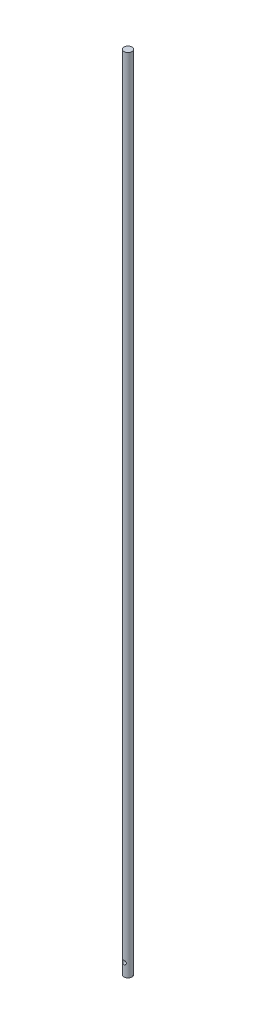
ISO-10303-21;
HEADER;
FILE_DESCRIPTION(('STEP AP214'),'2;1');
FILE_NAME('part.step','',(''),(''),'','','');
FILE_SCHEMA(('AUTOMOTIVE_DESIGN { 1 0 10303 214 1 1 1 1 }'));
ENDSEC;
DATA;
#1=APPLICATION_CONTEXT('core data for automotive mechanical design processes');
#2=APPLICATION_PROTOCOL_DEFINITION('international standard','automotive_design',2000,#1);
#3=PRODUCT_CONTEXT('',#1,'mechanical');
#4=PRODUCT('Part','Part','',(#3));
#5=PRODUCT_RELATED_PRODUCT_CATEGORY('part','',(#4));
#6=PRODUCT_DEFINITION_FORMATION('','',#4);
#7=PRODUCT_DEFINITION_CONTEXT('part definition',#1,'design');
#8=PRODUCT_DEFINITION('design','',#6,#7);
#9=PRODUCT_DEFINITION_SHAPE('','',#8);
#10=(LENGTH_UNIT() NAMED_UNIT(*) SI_UNIT(.MILLI.,.METRE.));
#11=(NAMED_UNIT(*) PLANE_ANGLE_UNIT() SI_UNIT($,.RADIAN.));
#12=(NAMED_UNIT(*) SI_UNIT($,.STERADIAN.) SOLID_ANGLE_UNIT());
#13=UNCERTAINTY_MEASURE_WITH_UNIT(LENGTH_MEASURE(1.E-05),#10,'distance_accuracy_value','');
#14=(GEOMETRIC_REPRESENTATION_CONTEXT(3) GLOBAL_UNCERTAINTY_ASSIGNED_CONTEXT((#13)) GLOBAL_UNIT_ASSIGNED_CONTEXT((#10,
#11,#12)) REPRESENTATION_CONTEXT('',''));
#15=CARTESIAN_POINT('',(0.,0.,0.));
#16=DIRECTION('',(0.,0.,1.));
#17=DIRECTION('',(1.,0.,0.));
#18=AXIS2_PLACEMENT_3D('',#15,#16,#17);
#19=CARTESIAN_POINT('',(0.,635.,0.));
#20=DIRECTION('',(0.,-1.,0.));
#21=DIRECTION('',(0.,0.,-1.));
#22=AXIS2_PLACEMENT_3D('',#19,#20,#21);
#23=CYLINDRICAL_SURFACE('',#22,3.175);
#24=CARTESIAN_POINT('',(0.,11.5000000000001,-3.175));
#25=CARTESIAN_POINT('',(-0.0793696056331806,11.4999955261037,-3.17499621985294));
#26=CARTESIAN_POINT('',(-0.158848966213305,11.4936633534843,-3.17199120370814));
#27=CARTESIAN_POINT('',(-0.315490796657684,11.4685996128575,-3.16026762742417));
#28=CARTESIAN_POINT('',(-0.392647876041661,11.4498412211258,-3.15153670753249));
#29=CARTESIAN_POINT('',(-0.542134614016446,11.4008046338603,-3.12928185140191));
#30=CARTESIAN_POINT('',(-0.614481134826971,11.3705694746881,-3.11577583396693));
#31=CARTESIAN_POINT('',(-0.752982757479876,11.2996444683175,-3.08523557557938));
#32=CARTESIAN_POINT('',(-0.819138798736997,11.2589562109142,-3.06820187122341));
#33=CARTESIAN_POINT('',(-0.94753197755138,11.1656866275469,-3.03109215002452));
#34=CARTESIAN_POINT('',(-1.00934531536297,11.1125689176526,-3.0108994960739));
#35=CARTESIAN_POINT('',(-1.1235687280467,10.9970940154181,-2.97016877751052));
#36=CARTESIAN_POINT('',(-1.1759724512306,10.9347306335115,-2.94963048974006));
#37=CARTESIAN_POINT('',(-1.27340721108708,10.7974843645497,-2.90895734211162));
#38=CARTESIAN_POINT('',(-1.31770529611401,10.7220415431449,-2.88894252906622));
#39=CARTESIAN_POINT('',(-1.39279860497067,10.5637145060508,-2.85350194913633));
#40=CARTESIAN_POINT('',(-1.4236026358555,10.4808351865709,-2.83807319122875));
#41=CARTESIAN_POINT('',(-1.46896762087975,10.3148173299765,-2.81484981523147));
#42=CARTESIAN_POINT('',(-1.48434942407678,10.2319591045865,-2.80667245171199));
#43=CARTESIAN_POINT('',(-1.50096994970779,10.0644666996695,-2.79782290647242));
#44=CARTESIAN_POINT('',(-1.50222015512641,9.97983401805994,-2.79714463118969));
#45=CARTESIAN_POINT('',(-1.49114871052963,9.82062469140227,-2.80305593263809));
#46=CARTESIAN_POINT('',(-1.48022366031688,9.74591684055565,-2.80889771224103));
#47=CARTESIAN_POINT('',(-1.44750469243097,9.59955531913525,-2.82589657910715));
#48=CARTESIAN_POINT('',(-1.42570787921158,9.52790246774061,-2.83705508237193));
#49=CARTESIAN_POINT('',(-1.37144042107044,9.38767854274785,-2.86368711079333));
#50=CARTESIAN_POINT('',(-1.33873421633753,9.3192173067294,-2.87925460442575));
#51=CARTESIAN_POINT('',(-1.26375034917988,9.18844422930819,-2.91294481240157));
#52=CARTESIAN_POINT('',(-1.22146847336963,9.12613511227864,-2.93106865023239));
#53=CARTESIAN_POINT('',(-1.12301829304093,9.00211398210143,-2.97027967308475));
#54=CARTESIAN_POINT('',(-1.06582685913966,8.94124465826452,-2.99147184174414));
#55=CARTESIAN_POINT('',(-0.94191165452174,8.82963307898788,-3.03276969244737));
#56=CARTESIAN_POINT('',(-0.875184240523152,8.77889471198727,-3.05287495516681));
#57=CARTESIAN_POINT('',(-0.730900451942534,8.68723446950543,-3.09065813188422));
#58=CARTESIAN_POINT('',(-0.6530327647494,8.64674987490942,-3.10821737934191));
#59=CARTESIAN_POINT('',(-0.490549806409977,8.57976514725874,-3.13795896561378));
#60=CARTESIAN_POINT('',(-0.405939389394631,8.55325505672057,-3.15014513198241));
#61=CARTESIAN_POINT('',(-0.239325331183679,8.51695327830056,-3.16698849385516));
#62=CARTESIAN_POINT('',(-0.157618085372384,8.50603697774869,-3.17215069636453));
#63=CARTESIAN_POINT('',(0.00662006237332813,8.49776549827474,-3.17605374308904));
#64=CARTESIAN_POINT('',(0.0891506200914207,8.50040487103401,-3.17479716715133));
#65=CARTESIAN_POINT('',(0.246790904756247,8.51845895022595,-3.16631250425399));
#66=CARTESIAN_POINT('',(0.322025617263283,8.53299968212116,-3.15949303898597));
#67=CARTESIAN_POINT('',(0.468859911387632,8.57312746629386,-3.14106249856194));
#68=CARTESIAN_POINT('',(0.540459070755479,8.5987157984244,-3.12945086824544));
#69=CARTESIAN_POINT('',(0.680482664613309,8.66097277598056,-3.10206629000487));
#70=CARTESIAN_POINT('',(0.748744433690331,8.69795459585583,-3.0861775760538));
#71=CARTESIAN_POINT('',(0.878333413113481,8.78160542554885,-3.05182842645659));
#72=CARTESIAN_POINT('',(0.93965756245345,8.82827868585655,-3.0333668635778));
#73=CARTESIAN_POINT('',(1.05944471500475,8.93484016430622,-2.99374847615918));
#74=CARTESIAN_POINT('',(1.11715821701519,8.99553803008258,-2.97249840501298));
#75=CARTESIAN_POINT('',(1.2218758216397,9.12592004337332,-2.93101070264009));
#76=CARTESIAN_POINT('',(1.2688744384349,9.1956087655742,-2.91077359415055));
#77=CARTESIAN_POINT('',(1.35231773600021,9.34515860569978,-2.87298422238289));
#78=CARTESIAN_POINT('',(1.3883357483136,9.42529027685061,-2.85555063245793));
#79=CARTESIAN_POINT('',(1.44599796651068,9.59157573608094,-2.82679504093384));
#80=CARTESIAN_POINT('',(1.46765854978947,9.67772253828128,-2.81546607860886));
#81=CARTESIAN_POINT('',(1.49416555358527,9.84513659709302,-2.80148148307169));
#82=CARTESIAN_POINT('',(1.50036748851185,9.92613047173134,-2.79812792823293));
#83=CARTESIAN_POINT('',(1.4995991124721,10.0880256718279,-2.79854075870541));
#84=CARTESIAN_POINT('',(1.4926327833113,10.1689270178634,-2.80230499174774));
#85=CARTESIAN_POINT('',(1.46695547456855,10.3218618581667,-2.81582109373829));
#86=CARTESIAN_POINT('',(1.44918362899975,10.394100315709,-2.82509293077012));
#87=CARTESIAN_POINT('',(1.40347262111119,10.5345289541074,-2.84807658169595));
#88=CARTESIAN_POINT('',(1.37553039996269,10.6027179098565,-2.86178973121637));
#89=CARTESIAN_POINT('',(1.30816165903837,10.7381105518292,-2.89323433363552));
#90=CARTESIAN_POINT('',(1.2680940753401,10.8049459695603,-2.91117262211889));
#91=CARTESIAN_POINT('',(1.1783806973407,10.9313607981843,-2.94862781691945));
#92=CARTESIAN_POINT('',(1.12873032344156,10.9909367174796,-2.96814547541437));
#93=CARTESIAN_POINT('',(1.01518945377103,11.1075560784686,-3.00898948839188));
#94=CARTESIAN_POINT('',(0.950355540908533,11.1636938134171,-3.03029315236505));
#95=CARTESIAN_POINT('',(0.811506446201228,11.264441754275,-3.07039060771353));
#96=CARTESIAN_POINT('',(0.737486850130151,11.3090463858981,-3.08918318329392));
#97=CARTESIAN_POINT('',(0.582310323359665,11.3850463197749,-3.12214803509559));
#98=CARTESIAN_POINT('',(0.501179295246573,11.4164873338392,-3.13633626105316));
#99=CARTESIAN_POINT('',(0.33404120248953,11.4649024240256,-3.15849550789229));
#100=CARTESIAN_POINT('',(0.248049357078893,11.4819192475963,-3.16648489362115));
#101=CARTESIAN_POINT('',(0.134449327489625,11.4942064333984,-3.17226666174443));
#102=CARTESIAN_POINT('',(0.107619750816221,11.4963765519968,-3.17328951708221));
#103=CARTESIAN_POINT('',(0.0538643319459629,11.4992741103809,-3.17465683516496));
#104=CARTESIAN_POINT('',(0.0269384876468103,11.5000015184656,-3.17500128300303));
#105=CARTESIAN_POINT('',(0.,11.5000000000001,-3.175));
#106=B_SPLINE_CURVE_WITH_KNOTS('',3,(#24,#25,#26,#27,#28,#29,#30,#31,#32,#33,#34,#35,#36,#37,
#38,#39,#40,#41,#42,#43,#44,#45,#46,#47,#48,#49,#50,#51,#52,#53,#54,#55,#56,#57,#58,#59,#60,#61,
#62,#63,#64,#65,#66,#67,#68,#69,#70,#71,#72,#73,#74,#75,#76,#77,#78,#79,#80,#81,#82,#83,#84,#85,
#86,#87,#88,#89,#90,#91,#92,#93,#94,#95,#96,#97,#98,#99,#100,#101,#102,#103,#104,#105),
.UNSPECIFIED.,.T.,.F.,(4,2,2,2,2,2,2,2,2,2,2,2,2,2,2,2,2,2,2,2,2,2,2,2,2,2,2,2,2,2,2,2,2,2,2,2,
2,2,2,2,4),(0.,0.237998863435115,0.476513162034362,0.714141760487192,0.951734239756919,
1.20256626735199,1.45356698050228,1.72144991719773,1.98915775546695,2.24170968929964,
2.49405639094993,2.72018464462584,2.94637315667187,3.17780125644155,3.4093313852857,
3.66670059385933,3.92416839616743,4.19124985366182,4.45814074508091,4.70459764976703,
4.9509555058397,5.18069145066333,5.41045401730287,5.64720089890941,5.88405183355055,
6.14213867221337,6.40035735120204,6.66760822573518,6.93455372246492,7.17710763594644,
7.41958821796885,7.64352093670393,7.8675210608749,8.10644389425158,8.34548119240928,
8.60934561245709,8.87333732850242,9.13640455025376,9.39868939423,9.47946576344207,
9.56024390756228),.UNSPECIFIED.);
#107=CARTESIAN_POINT('',(0.,11.5000000000001,-3.175));
#108=VERTEX_POINT('',#107);
#109=EDGE_CURVE('E10',#108,#108,#106,.T.);
#110=ORIENTED_EDGE('',*,*,#109,.T.);
#111=EDGE_LOOP('',(#110));
#112=FACE_BOUND('',#111,.T.);
#113=CARTESIAN_POINT('',(1.5,10.,2.7983253920872));
#114=CARTESIAN_POINT('',(1.49999523547047,9.92118925239899,2.79833097649977));
#115=CARTESIAN_POINT('',(1.49374832449328,9.84226438779429,2.80170427159323));
#116=CARTESIAN_POINT('',(1.4690554061353,9.68678533248534,2.81472644561665));
#117=CARTESIAN_POINT('',(1.45058101361493,9.61023709283713,2.82438992585351));
#118=CARTESIAN_POINT('',(1.40237253355637,9.4620473262433,2.84863009396432));
#119=CARTESIAN_POINT('',(1.37269332197988,9.39038386356822,2.86318279906115));
#120=CARTESIAN_POINT('',(1.30308399064544,9.25307060715245,2.89552502377022));
#121=CARTESIAN_POINT('',(1.26315430701282,9.18742055772114,2.91331440566266));
#122=CARTESIAN_POINT('',(1.17074308715242,9.05867675474164,2.95172227722859));
#123=CARTESIAN_POINT('',(1.11755658650798,8.99612211150936,2.97245254188492));
#124=CARTESIAN_POINT('',(1.00161259672225,8.88040856315068,3.01349951044785));
#125=CARTESIAN_POINT('',(0.93885077249198,8.82725393739964,3.03381602228765));
#126=CARTESIAN_POINT('',(0.801034900704557,8.72881062045227,3.07317288716968));
#127=CARTESIAN_POINT('',(0.725476017233409,8.6841654987483,3.09206866660244));
#128=CARTESIAN_POINT('',(0.566861686619207,8.60846247793828,3.1250338159502));
#129=CARTESIAN_POINT('',(0.483810507023606,8.57739690225476,3.13910591174127));
#130=CARTESIAN_POINT('',(0.318263833167192,8.53180568014386,3.16003750546178));
#131=CARTESIAN_POINT('',(0.236079837596879,8.51634019939963,3.1673046412502));
#132=CARTESIAN_POINT('',(0.0699854874354634,8.49931330153707,3.17531500926785));
#133=CARTESIAN_POINT('',(-0.0139239243030745,8.49774448287967,3.17606171435844));
#134=CARTESIAN_POINT('',(-0.17410404695587,8.50814689261955,3.1711569999128));
#135=CARTESIAN_POINT('',(-0.250460926307501,8.51907363157191,3.16599910390163));
#136=CARTESIAN_POINT('',(-0.400106757592272,8.55231548800515,3.15058713309443));
#137=CARTESIAN_POINT('',(-0.473395481043905,8.57463145199998,3.14033267949386));
#138=CARTESIAN_POINT('',(-0.616162159992436,8.63021819188029,3.11549383971164));
#139=CARTESIAN_POINT('',(-0.685567785451905,8.66364599997404,3.10084769916083));
#140=CARTESIAN_POINT('',(-0.81796221828409,8.74031903647797,3.06858481389696));
#141=CARTESIAN_POINT('',(-0.88094866348999,8.78356786011826,3.05096698193042));
#142=CARTESIAN_POINT('',(-1.00453666893051,8.88298223432991,3.01265189942244));
#143=CARTESIAN_POINT('',(-1.06445784147848,8.93994263196852,2.99182009431091));
#144=CARTESIAN_POINT('',(-1.17424124933887,9.06300294035555,2.9504628336178));
#145=CARTESIAN_POINT('',(-1.22409717105708,9.12910854404883,2.92993757775204));
#146=CARTESIAN_POINT('',(-1.31484174230843,9.27282786184891,2.89039711066439));
#147=CARTESIAN_POINT('',(-1.35512986365459,9.35086105800369,2.87151577260244));
#148=CARTESIAN_POINT('',(-1.42170562946271,9.51371625646894,2.83914834140002));
#149=CARTESIAN_POINT('',(-1.44800645544407,9.59853178012434,2.82565717160028));
#150=CARTESIAN_POINT('',(-1.48387059914898,9.76574629526237,2.8069797461398));
#151=CARTESIAN_POINT('',(-1.49454991359959,9.84784244193012,2.80124227464674));
#152=CARTESIAN_POINT('',(-1.50221328025957,10.0128364544628,2.79714234532468));
#153=CARTESIAN_POINT('',(-1.49920488189904,10.0957338532268,2.79877582206013));
#154=CARTESIAN_POINT('',(-1.48060173475641,10.2518411011807,2.80865284380238));
#155=CARTESIAN_POINT('',(-1.46619608896936,10.3252381335396,2.81627144126263));
#156=CARTESIAN_POINT('',(-1.42690562153977,10.4684636330513,2.83637948512088));
#157=CARTESIAN_POINT('',(-1.40201781025964,10.5382910757385,2.84887032106379));
#158=CARTESIAN_POINT('',(-1.34123245942743,10.6760358075249,2.87800314814946));
#159=CARTESIAN_POINT('',(-1.3048795889842,10.74371599414,2.8948101939309));
#160=CARTESIAN_POINT('',(-1.22260967416885,10.8723898286007,2.93050507850423));
#161=CARTESIAN_POINT('',(-1.17668785898321,10.933380117806,2.94939395301751));
#162=CARTESIAN_POINT('',(-1.07066250220432,11.0539512242928,2.98962533435875));
#163=CARTESIAN_POINT('',(-1.00955462247672,11.1126390091906,3.01100918444459));
#164=CARTESIAN_POINT('',(-0.877952835832762,11.2191662131219,3.05197816465584));
#165=CARTESIAN_POINT('',(-0.807456777596048,11.2670031388463,3.0715628807626));
#166=CARTESIAN_POINT('',(-0.657374049291631,11.351063404327,3.10717258491726));
#167=CARTESIAN_POINT('',(-0.577656753882361,11.3870824417787,3.12313361565428));
#168=CARTESIAN_POINT('',(-0.412327293299616,11.4448659350236,3.14922093597641));
#169=CARTESIAN_POINT('',(-0.326719797872911,11.4666415423121,3.15935178938715));
#170=CARTESIAN_POINT('',(-0.159896332874255,11.4936388943546,3.17197971044583));
#171=CARTESIAN_POINT('',(-0.0789253982841121,11.5001101363264,3.17505233840112));
#172=CARTESIAN_POINT('',(0.0829833461656818,11.4998871196569,3.17494636529876));
#173=CARTESIAN_POINT('',(0.163921158962968,11.493196535111,3.17176950877122));
#174=CARTESIAN_POINT('',(0.318841842835509,11.4677084802309,3.15985410378094));
#175=CARTESIAN_POINT('',(0.392963167600575,11.44959197492,3.15142868675494));
#176=CARTESIAN_POINT('',(0.537026434022449,11.4026210854748,3.13010132928977));
#177=CARTESIAN_POINT('',(0.606967708473987,11.3737649924089,3.11719867643471));
#178=CARTESIAN_POINT('',(0.744198443618395,11.3047349018929,3.08738510301286));
#179=CARTESIAN_POINT('',(0.81122628613105,11.2641093939083,3.07031972986791));
#180=CARTESIAN_POINT('',(0.93780541290751,11.1732843209198,3.03405477724483));
#181=CARTESIAN_POINT('',(0.99735328179628,11.1230804085549,3.01485423033005));
#182=CARTESIAN_POINT('',(1.11287613406115,11.0092844677809,2.9742574938223));
#183=CARTESIAN_POINT('',(1.16805442942679,10.9448963731737,2.95281858853931));
#184=CARTESIAN_POINT('',(1.26705651381274,10.8073121457486,2.91171333700678));
#185=CARTESIAN_POINT('',(1.3108719601901,10.7341095987446,2.89204830000694));
#186=CARTESIAN_POINT('',(1.38637379820338,10.5792324222109,2.85663554941128));
#187=CARTESIAN_POINT('',(1.41785130272301,10.4974393525253,2.84095675906998));
#188=CARTESIAN_POINT('',(1.46612321204659,10.3288119983293,2.81635628214137));
#189=CARTESIAN_POINT('',(1.48296690968123,10.2419956966721,2.80741192483264));
#190=CARTESIAN_POINT('',(1.49469268672872,10.128694633248,2.80116429672363));
#191=CARTESIAN_POINT('',(1.49668048940514,10.1030118077476,2.80010260103933));
#192=CARTESIAN_POINT('',(1.49933495903092,10.0515567295082,2.79868221732461));
#193=CARTESIAN_POINT('',(1.50000155880871,10.0257844722891,2.79832356503778));
#194=CARTESIAN_POINT('',(1.5,10.,2.7983253920872));
#195=B_SPLINE_CURVE_WITH_KNOTS('',3,(#113,#114,#115,#116,#117,#118,#119,#120,#121,#122,#123,
#124,#125,#126,#127,#128,#129,#130,#131,#132,#133,#134,#135,#136,#137,#138,#139,#140,#141,#142,
#143,#144,#145,#146,#147,#148,#149,#150,#151,#152,#153,#154,#155,#156,#157,#158,#159,#160,#161,
#162,#163,#164,#165,#166,#167,#168,#169,#170,#171,#172,#173,#174,#175,#176,#177,#178,#179,#180,
#181,#182,#183,#184,#185,#186,#187,#188,#189,#190,#191,#192,#193,#194),.UNSPECIFIED.,.T.,.F.,(4,
2,2,2,2,2,2,2,2,2,2,2,2,2,2,2,2,2,2,2,2,2,2,2,2,2,2,2,2,2,2,2,2,2,2,2,2,2,2,2,4),(0.,
0.236323871838538,0.47319828428929,0.708927337380679,0.944646362603888,1.19762429635861,
1.4507171039535,1.71864285343493,1.98641694681209,2.23687152724751,2.48719270436032,
2.71802817018656,2.94888079555671,3.18314531005557,3.41749572162703,3.67216706074961,
3.92699765369084,4.19506898546712,4.46288723920475,4.71043828617542,4.95785281342709,
5.1823979695074,5.40700721193723,5.64198832122133,5.87708686716677,6.1380463795808,
6.3990657946317,6.66438519401189,6.92949661955735,7.17207877892641,7.41459323161725,
7.64386670961207,7.87317668624817,8.11282240294702,8.35257714778313,8.61378861881709,
8.87519133270398,9.14084608292561,9.40560248746473,9.48291651801967,9.56023447921351),.UNSPECIFIED.);
#196=CARTESIAN_POINT('',(1.5,10.,2.7983253920872));
#197=VERTEX_POINT('',#196);
#198=EDGE_CURVE('E48',#197,#197,#195,.T.);
#199=ORIENTED_EDGE('',*,*,#198,.T.);
#200=EDGE_LOOP('',(#199));
#201=FACE_BOUND('',#200,.T.);
#202=CARTESIAN_POINT('',(0.,635.,0.));
#203=DIRECTION('',(0.,1.,0.));
#204=DIRECTION('',(0.,0.,1.));
#205=AXIS2_PLACEMENT_3D('',#202,#203,#204);
#206=CIRCLE('',#205,3.175);
#207=CARTESIAN_POINT('',(0.,635.,3.175));
#208=VERTEX_POINT('',#207);
#209=EDGE_CURVE('E52',#208,#208,#206,.T.);
#210=ORIENTED_EDGE('',*,*,#209,.F.);
#211=EDGE_LOOP('',(#210));
#212=FACE_BOUND('',#211,.T.);
#213=CARTESIAN_POINT('',(0.,0.,0.));
#214=DIRECTION('',(0.,1.,0.));
#215=DIRECTION('',(0.,0.,1.));
#216=AXIS2_PLACEMENT_3D('',#213,#214,#215);
#217=CIRCLE('',#216,3.175);
#218=CARTESIAN_POINT('',(0.,0.,3.175));
#219=VERTEX_POINT('',#218);
#220=EDGE_CURVE('E56',#219,#219,#217,.T.);
#221=ORIENTED_EDGE('',*,*,#220,.T.);
#222=EDGE_LOOP('',(#221));
#223=FACE_BOUND('',#222,.T.);
#224=ADVANCED_FACE('F37',(#112,#201,#212,#223),#23,.T.);
#225=CARTESIAN_POINT('',(0.,635.,0.));
#226=DIRECTION('',(0.,1.,0.));
#227=DIRECTION('',(0.,0.,1.));
#228=AXIS2_PLACEMENT_3D('',#225,#226,#227);
#229=PLANE('',#228);
#230=ORIENTED_EDGE('',*,*,#209,.T.);
#231=EDGE_LOOP('',(#230));
#232=FACE_BOUND('',#231,.T.);
#233=ADVANCED_FACE('F68',(#232),#229,.T.);
#234=CARTESIAN_POINT('',(0.,0.,0.));
#235=DIRECTION('',(0.,1.,0.));
#236=DIRECTION('',(0.,0.,1.));
#237=AXIS2_PLACEMENT_3D('',#234,#235,#236);
#238=PLANE('',#237);
#239=ORIENTED_EDGE('',*,*,#220,.F.);
#240=EDGE_LOOP('',(#239));
#241=FACE_BOUND('',#240,.T.);
#242=ADVANCED_FACE('F66',(#241),#238,.F.);
#243=CARTESIAN_POINT('',(0.,10.,-3.175));
#244=DIRECTION('',(0.,0.,1.));
#245=DIRECTION('',(1.,0.,0.));
#246=AXIS2_PLACEMENT_3D('',#243,#244,#245);
#247=CYLINDRICAL_SURFACE('',#246,1.5);
#248=ORIENTED_EDGE('',*,*,#198,.F.);
#249=EDGE_LOOP('',(#248));
#250=FACE_BOUND('',#249,.T.);
#251=ORIENTED_EDGE('',*,*,#109,.F.);
#252=EDGE_LOOP('',(#251));
#253=FACE_BOUND('',#252,.T.);
#254=ADVANCED_FACE('F62',(#250,#253),#247,.F.);
#255=CLOSED_SHELL('',(#224,#233,#242,#254));
#256=MANIFOLD_SOLID_BREP('B2',#255);
#257=ADVANCED_BREP_SHAPE_REPRESENTATION('',(#18,#256),#14);
#258=SHAPE_DEFINITION_REPRESENTATION(#9,#257);
ENDSEC;
END-ISO-10303-21;
